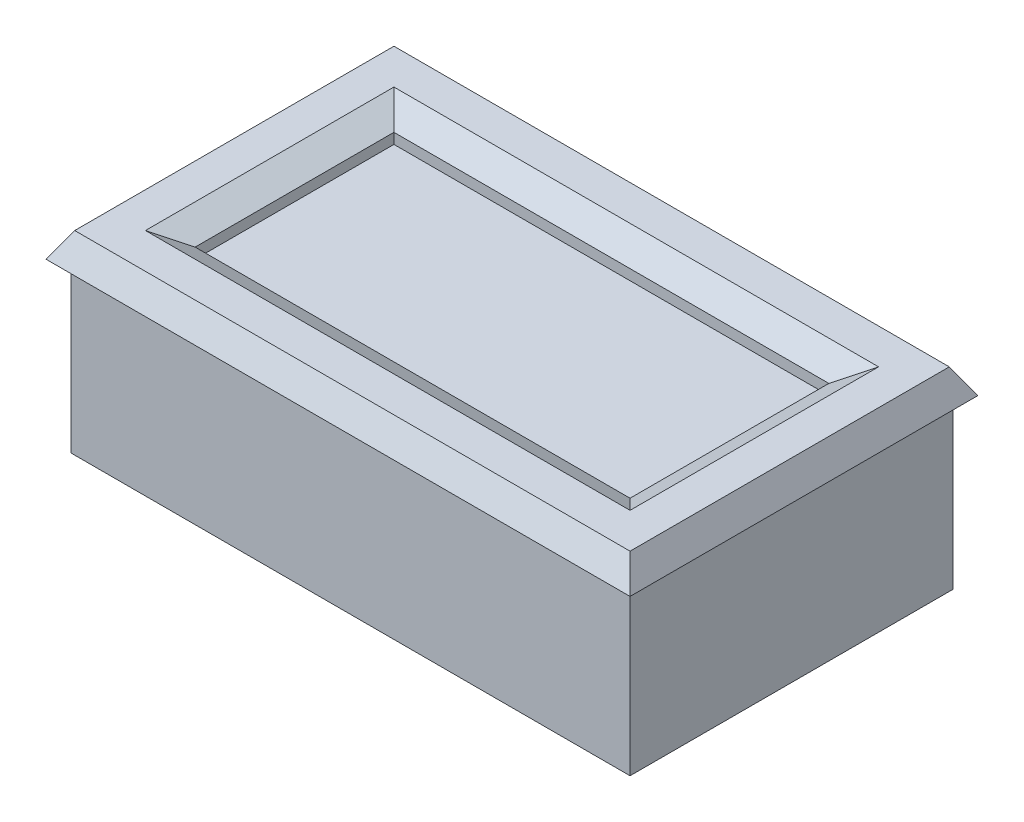
ISO-10303-21;
HEADER;
FILE_DESCRIPTION(('STEP AP214'),'2;1');
FILE_NAME('part.step','',(''),(''),'','','');
FILE_SCHEMA(('AUTOMOTIVE_DESIGN { 1 0 10303 214 1 1 1 1 }'));
ENDSEC;
DATA;
#1=APPLICATION_CONTEXT('core data for automotive mechanical design processes');
#2=APPLICATION_PROTOCOL_DEFINITION('international standard','automotive_design',2000,#1);
#3=PRODUCT_CONTEXT('',#1,'mechanical');
#4=PRODUCT('Part','Part','',(#3));
#5=PRODUCT_RELATED_PRODUCT_CATEGORY('part','',(#4));
#6=PRODUCT_DEFINITION_FORMATION('','',#4);
#7=PRODUCT_DEFINITION_CONTEXT('part definition',#1,'design');
#8=PRODUCT_DEFINITION('design','',#6,#7);
#9=PRODUCT_DEFINITION_SHAPE('','',#8);
#10=(LENGTH_UNIT() NAMED_UNIT(*) SI_UNIT(.MILLI.,.METRE.));
#11=(NAMED_UNIT(*) PLANE_ANGLE_UNIT() SI_UNIT($,.RADIAN.));
#12=(NAMED_UNIT(*) SI_UNIT($,.STERADIAN.) SOLID_ANGLE_UNIT());
#13=UNCERTAINTY_MEASURE_WITH_UNIT(LENGTH_MEASURE(1.E-05),#10,'distance_accuracy_value','');
#14=(GEOMETRIC_REPRESENTATION_CONTEXT(3) GLOBAL_UNCERTAINTY_ASSIGNED_CONTEXT((#13)) GLOBAL_UNIT_ASSIGNED_CONTEXT((#10,
#11,#12)) REPRESENTATION_CONTEXT('',''));
#15=CARTESIAN_POINT('',(0.,0.,0.));
#16=DIRECTION('',(0.,0.,1.));
#17=DIRECTION('',(1.,0.,0.));
#18=AXIS2_PLACEMENT_3D('',#15,#16,#17);
#19=CARTESIAN_POINT('',(22.5,13.5,13.));
#20=DIRECTION('',(-1.,0.,0.));
#21=DIRECTION('',(0.,0.,1.));
#22=AXIS2_PLACEMENT_3D('',#19,#20,#21);
#23=PLANE('',#22);
#24=DIRECTION('',(0.,0.,-1.));
#25=VECTOR('',#24,1.);
#26=CARTESIAN_POINT('',(22.5,0.,13.));
#27=LINE('',#26,#25);
#28=CARTESIAN_POINT('',(22.5,0.,13.));
#29=VERTEX_POINT('',#28);
#30=CARTESIAN_POINT('',(22.5,0.,-13.));
#31=VERTEX_POINT('',#30);
#32=EDGE_CURVE('E237',#29,#31,#27,.T.);
#33=ORIENTED_EDGE('',*,*,#32,.T.);
#34=DIRECTION('',(0.,-1.,0.));
#35=VECTOR('',#34,1.);
#36=CARTESIAN_POINT('',(22.5,13.5,-13.));
#37=LINE('',#36,#35);
#38=CARTESIAN_POINT('',(22.5,13.5,-13.));
#39=VERTEX_POINT('',#38);
#40=EDGE_CURVE('E267',#39,#31,#37,.T.);
#41=ORIENTED_EDGE('',*,*,#40,.F.);
#42=DIRECTION('',(0.,0.,-1.));
#43=VECTOR('',#42,1.);
#44=CARTESIAN_POINT('',(22.5,13.5,13.));
#45=LINE('',#44,#43);
#46=CARTESIAN_POINT('',(22.5,13.5,13.));
#47=VERTEX_POINT('',#46);
#48=EDGE_CURVE('E238',#47,#39,#45,.T.);
#49=ORIENTED_EDGE('',*,*,#48,.F.);
#50=DIRECTION('',(0.,-1.,0.));
#51=VECTOR('',#50,1.);
#52=CARTESIAN_POINT('',(22.5,13.5,13.));
#53=LINE('',#52,#51);
#54=EDGE_CURVE('E251',#47,#29,#53,.T.);
#55=ORIENTED_EDGE('',*,*,#54,.T.);
#56=EDGE_LOOP('',(#33,#41,#49,#55));
#57=FACE_BOUND('',#56,.T.);
#58=ADVANCED_FACE('F38',(#57),#23,.F.);
#59=CARTESIAN_POINT('',(-22.5,13.5,-13.));
#60=DIRECTION('',(0.,0.,1.));
#61=DIRECTION('',(1.,0.,0.));
#62=AXIS2_PLACEMENT_3D('',#59,#60,#61);
#63=PLANE('',#62);
#64=DIRECTION('',(-1.,0.,0.));
#65=VECTOR('',#64,1.);
#66=CARTESIAN_POINT('',(-22.5,0.,-13.));
#67=LINE('',#66,#65);
#68=CARTESIAN_POINT('',(-22.5,0.,-13.));
#69=VERTEX_POINT('',#68);
#70=EDGE_CURVE('E254',#31,#69,#67,.T.);
#71=ORIENTED_EDGE('',*,*,#70,.T.);
#72=DIRECTION('',(0.,-1.,0.));
#73=VECTOR('',#72,1.);
#74=CARTESIAN_POINT('',(-22.5,13.5,-13.));
#75=LINE('',#74,#73);
#76=CARTESIAN_POINT('',(-22.5,13.5,-13.));
#77=VERTEX_POINT('',#76);
#78=EDGE_CURVE('E264',#77,#69,#75,.T.);
#79=ORIENTED_EDGE('',*,*,#78,.F.);
#80=DIRECTION('',(-1.,0.,0.));
#81=VECTOR('',#80,1.);
#82=CARTESIAN_POINT('',(-22.5,13.5,-13.));
#83=LINE('',#82,#81);
#84=EDGE_CURVE('E241',#39,#77,#83,.T.);
#85=ORIENTED_EDGE('',*,*,#84,.F.);
#86=ORIENTED_EDGE('',*,*,#40,.T.);
#87=EDGE_LOOP('',(#71,#79,#85,#86));
#88=FACE_BOUND('',#87,.T.);
#89=ADVANCED_FACE('F342',(#88),#63,.F.);
#90=CARTESIAN_POINT('',(-22.5,13.5,13.));
#91=DIRECTION('',(1.,0.,0.));
#92=DIRECTION('',(0.,0.,-1.));
#93=AXIS2_PLACEMENT_3D('',#90,#91,#92);
#94=PLANE('',#93);
#95=DIRECTION('',(0.,0.,1.));
#96=VECTOR('',#95,1.);
#97=CARTESIAN_POINT('',(-22.5,0.,13.));
#98=LINE('',#97,#96);
#99=CARTESIAN_POINT('',(-22.5,0.,13.));
#100=VERTEX_POINT('',#99);
#101=EDGE_CURVE('E256',#69,#100,#98,.T.);
#102=ORIENTED_EDGE('',*,*,#101,.T.);
#103=DIRECTION('',(0.,-1.,0.));
#104=VECTOR('',#103,1.);
#105=CARTESIAN_POINT('',(-22.5,13.5,13.));
#106=LINE('',#105,#104);
#107=CARTESIAN_POINT('',(-22.5,13.5,13.));
#108=VERTEX_POINT('',#107);
#109=EDGE_CURVE('E261',#108,#100,#106,.T.);
#110=ORIENTED_EDGE('',*,*,#109,.F.);
#111=DIRECTION('',(0.,0.,1.));
#112=VECTOR('',#111,1.);
#113=CARTESIAN_POINT('',(-22.5,13.5,13.));
#114=LINE('',#113,#112);
#115=EDGE_CURVE('E245',#77,#108,#114,.T.);
#116=ORIENTED_EDGE('',*,*,#115,.F.);
#117=ORIENTED_EDGE('',*,*,#78,.T.);
#118=EDGE_LOOP('',(#102,#110,#116,#117));
#119=FACE_BOUND('',#118,.T.);
#120=ADVANCED_FACE('F348',(#119),#94,.F.);
#121=CARTESIAN_POINT('',(-22.5,13.5,13.));
#122=DIRECTION('',(0.,0.,-1.));
#123=DIRECTION('',(-1.,0.,0.));
#124=AXIS2_PLACEMENT_3D('',#121,#122,#123);
#125=PLANE('',#124);
#126=DIRECTION('',(1.,0.,0.));
#127=VECTOR('',#126,1.);
#128=CARTESIAN_POINT('',(-22.5,0.,13.));
#129=LINE('',#128,#127);
#130=EDGE_CURVE('E242',#100,#29,#129,.T.);
#131=ORIENTED_EDGE('',*,*,#130,.T.);
#132=ORIENTED_EDGE('',*,*,#54,.F.);
#133=DIRECTION('',(1.,0.,0.));
#134=VECTOR('',#133,1.);
#135=CARTESIAN_POINT('',(-22.5,13.5,13.));
#136=LINE('',#135,#134);
#137=EDGE_CURVE('E248',#108,#47,#136,.T.);
#138=ORIENTED_EDGE('',*,*,#137,.F.);
#139=ORIENTED_EDGE('',*,*,#109,.T.);
#140=EDGE_LOOP('',(#131,#132,#138,#139));
#141=FACE_BOUND('',#140,.T.);
#142=ADVANCED_FACE('F473',(#141),#125,.F.);
#143=CARTESIAN_POINT('',(0.,0.,0.));
#144=DIRECTION('',(0.,-1.,0.));
#145=DIRECTION('',(0.,0.,-1.));
#146=AXIS2_PLACEMENT_3D('',#143,#144,#145);
#147=PLANE('',#146);
#148=DIRECTION('',(1.,0.,0.));
#149=VECTOR('',#148,1.);
#150=CARTESIAN_POINT('',(-22.,0.,-7.));
#151=LINE('',#150,#149);
#152=CARTESIAN_POINT('',(-22.,0.,-7.));
#153=VERTEX_POINT('',#152);
#154=CARTESIAN_POINT('',(-19.5,0.,-7.));
#155=VERTEX_POINT('',#154);
#156=EDGE_CURVE('E182',#153,#155,#151,.T.);
#157=ORIENTED_EDGE('',*,*,#156,.F.);
#158=DIRECTION('',(0.,0.,-1.));
#159=VECTOR('',#158,1.);
#160=CARTESIAN_POINT('',(-22.,0.,-7.));
#161=LINE('',#160,#159);
#162=CARTESIAN_POINT('',(-22.,0.,-4.));
#163=VERTEX_POINT('',#162);
#164=EDGE_CURVE('E193',#163,#153,#161,.T.);
#165=ORIENTED_EDGE('',*,*,#164,.F.);
#166=DIRECTION('',(-1.,0.,0.));
#167=VECTOR('',#166,1.);
#168=CARTESIAN_POINT('',(-22.,0.,-4.));
#169=LINE('',#168,#167);
#170=CARTESIAN_POINT('',(-19.5,0.,-4.));
#171=VERTEX_POINT('',#170);
#172=EDGE_CURVE('E56',#171,#163,#169,.T.);
#173=ORIENTED_EDGE('',*,*,#172,.F.);
#174=CARTESIAN_POINT('',(-19.5,0.,-5.5));
#175=DIRECTION('',(0.,-1.,0.));
#176=DIRECTION('',(0.,0.,1.));
#177=AXIS2_PLACEMENT_3D('',#174,#175,#176);
#178=CIRCLE('',#177,1.5);
#179=EDGE_CURVE('E189',#155,#171,#178,.T.);
#180=ORIENTED_EDGE('',*,*,#179,.F.);
#181=EDGE_LOOP('',(#157,#165,#173,#180));
#182=FACE_BOUND('',#181,.T.);
#183=ORIENTED_EDGE('',*,*,#32,.F.);
#184=ORIENTED_EDGE('',*,*,#130,.F.);
#185=ORIENTED_EDGE('',*,*,#101,.F.);
#186=ORIENTED_EDGE('',*,*,#70,.F.);
#187=EDGE_LOOP('',(#183,#184,#185,#186));
#188=FACE_BOUND('',#187,.T.);
#189=ADVANCED_FACE('F339',(#182,#188),#147,.T.);
#190=CARTESIAN_POINT('',(0.,13.5,0.));
#191=DIRECTION('',(0.,1.,0.));
#192=DIRECTION('',(0.,0.,1.));
#193=AXIS2_PLACEMENT_3D('',#190,#191,#192);
#194=PLANE('',#193);
#195=DIRECTION('',(1.,0.,0.));
#196=VECTOR('',#195,1.);
#197=CARTESIAN_POINT('',(-23.5,13.5,14.));
#198=LINE('',#197,#196);
#199=CARTESIAN_POINT('',(-23.5,13.5,14.));
#200=VERTEX_POINT('',#199);
#201=CARTESIAN_POINT('',(23.5,13.5,14.));
#202=VERTEX_POINT('',#201);
#203=EDGE_CURVE('E225',#200,#202,#198,.T.);
#204=ORIENTED_EDGE('',*,*,#203,.F.);
#205=DIRECTION('',(0.,0.,1.));
#206=VECTOR('',#205,1.);
#207=CARTESIAN_POINT('',(-23.5,13.5,-14.));
#208=LINE('',#207,#206);
#209=CARTESIAN_POINT('',(-23.5,13.5,-14.));
#210=VERTEX_POINT('',#209);
#211=EDGE_CURVE('E234',#210,#200,#208,.T.);
#212=ORIENTED_EDGE('',*,*,#211,.F.);
#213=DIRECTION('',(-1.,0.,0.));
#214=VECTOR('',#213,1.);
#215=CARTESIAN_POINT('',(23.5,13.5,-14.));
#216=LINE('',#215,#214);
#217=CARTESIAN_POINT('',(23.5,13.5,-14.));
#218=VERTEX_POINT('',#217);
#219=EDGE_CURVE('E231',#218,#210,#216,.T.);
#220=ORIENTED_EDGE('',*,*,#219,.F.);
#221=DIRECTION('',(0.,0.,-1.));
#222=VECTOR('',#221,1.);
#223=CARTESIAN_POINT('',(23.5,13.5,14.));
#224=LINE('',#223,#222);
#225=EDGE_CURVE('E228',#202,#218,#224,.T.);
#226=ORIENTED_EDGE('',*,*,#225,.F.);
#227=EDGE_LOOP('',(#204,#212,#220,#226));
#228=FACE_BOUND('',#227,.T.);
#229=ORIENTED_EDGE('',*,*,#137,.T.);
#230=ORIENTED_EDGE('',*,*,#48,.T.);
#231=ORIENTED_EDGE('',*,*,#84,.T.);
#232=ORIENTED_EDGE('',*,*,#115,.T.);
#233=EDGE_LOOP('',(#229,#230,#231,#232));
#234=FACE_BOUND('',#233,.T.);
#235=ADVANCED_FACE('F320',(#228,#234),#194,.F.);
#236=CARTESIAN_POINT('',(0.,15.5,0.));
#237=DIRECTION('',(0.,1.,0.));
#238=DIRECTION('',(0.,0.,1.));
#239=AXIS2_PLACEMENT_3D('',#236,#237,#238);
#240=PLANE('',#239);
#241=DIRECTION('',(0.,0.,-1.));
#242=VECTOR('',#241,1.);
#243=CARTESIAN_POINT('',(-19.5,15.5,0.));
#244=LINE('',#243,#242);
#245=CARTESIAN_POINT('',(-19.5,15.5,10.));
#246=VERTEX_POINT('',#245);
#247=CARTESIAN_POINT('',(-19.5,15.5,-10.));
#248=VERTEX_POINT('',#247);
#249=EDGE_CURVE('E286',#246,#248,#244,.T.);
#250=ORIENTED_EDGE('',*,*,#249,.T.);
#251=DIRECTION('',(1.,0.,0.));
#252=VECTOR('',#251,1.);
#253=CARTESIAN_POINT('',(0.,15.5,-10.));
#254=LINE('',#253,#252);
#255=CARTESIAN_POINT('',(19.5,15.5,-10.));
#256=VERTEX_POINT('',#255);
#257=EDGE_CURVE('E288',#248,#256,#254,.T.);
#258=ORIENTED_EDGE('',*,*,#257,.T.);
#259=DIRECTION('',(0.,0.,1.));
#260=VECTOR('',#259,1.);
#261=CARTESIAN_POINT('',(19.5,15.5,0.));
#262=LINE('',#261,#260);
#263=CARTESIAN_POINT('',(19.5,15.5,10.));
#264=VERTEX_POINT('',#263);
#265=EDGE_CURVE('E282',#256,#264,#262,.T.);
#266=ORIENTED_EDGE('',*,*,#265,.T.);
#267=DIRECTION('',(-1.,0.,0.));
#268=VECTOR('',#267,1.);
#269=CARTESIAN_POINT('',(0.,15.5,10.));
#270=LINE('',#269,#268);
#271=EDGE_CURVE('E284',#264,#246,#270,.T.);
#272=ORIENTED_EDGE('',*,*,#271,.T.);
#273=EDGE_LOOP('',(#250,#258,#266,#272));
#274=FACE_BOUND('',#273,.T.);
#275=DIRECTION('',(-1.,0.,0.));
#276=VECTOR('',#275,1.);
#277=CARTESIAN_POINT('',(-23.5,15.5,-12.8452994616207));
#278=LINE('',#277,#276);
#279=CARTESIAN_POINT('',(22.3452994616207,15.5,-12.8452994616207));
#280=VERTEX_POINT('',#279);
#281=CARTESIAN_POINT('',(-22.3452994616208,15.5,-12.8452994616207));
#282=VERTEX_POINT('',#281);
#283=EDGE_CURVE('E277',#280,#282,#278,.T.);
#284=ORIENTED_EDGE('',*,*,#283,.T.);
#285=DIRECTION('',(0.,0.,1.));
#286=VECTOR('',#285,1.);
#287=CARTESIAN_POINT('',(-22.3452994616208,15.5,14.));
#288=LINE('',#287,#286);
#289=CARTESIAN_POINT('',(-22.3452994616208,15.5,12.8452994616208));
#290=VERTEX_POINT('',#289);
#291=EDGE_CURVE('E279',#282,#290,#288,.T.);
#292=ORIENTED_EDGE('',*,*,#291,.T.);
#293=DIRECTION('',(1.,0.,0.));
#294=VECTOR('',#293,1.);
#295=CARTESIAN_POINT('',(23.5,15.5,12.8452994616208));
#296=LINE('',#295,#294);
#297=CARTESIAN_POINT('',(22.3452994616207,15.5,12.8452994616208));
#298=VERTEX_POINT('',#297);
#299=EDGE_CURVE('E273',#290,#298,#296,.T.);
#300=ORIENTED_EDGE('',*,*,#299,.T.);
#301=DIRECTION('',(0.,0.,-1.));
#302=VECTOR('',#301,1.);
#303=CARTESIAN_POINT('',(22.3452994616207,15.5,-14.));
#304=LINE('',#303,#302);
#305=EDGE_CURVE('E275',#298,#280,#304,.T.);
#306=ORIENTED_EDGE('',*,*,#305,.T.);
#307=EDGE_LOOP('',(#284,#292,#300,#306));
#308=FACE_BOUND('',#307,.T.);
#309=ADVANCED_FACE('F328',(#274,#308),#240,.T.);
#310=CARTESIAN_POINT('',(-17.5,15.5,8.));
#311=DIRECTION('',(0.,0.,-1.));
#312=DIRECTION('',(-1.,0.,0.));
#313=AXIS2_PLACEMENT_3D('',#310,#311,#312);
#314=PLANE('',#313);
#315=DIRECTION('',(0.,-1.,0.));
#316=VECTOR('',#315,1.);
#317=CARTESIAN_POINT('',(-17.5,15.5,8.));
#318=LINE('',#317,#316);
#319=CARTESIAN_POINT('',(-17.5,14.3452994616207,8.));
#320=VERTEX_POINT('',#319);
#321=CARTESIAN_POINT('',(-17.5,13.5,8.));
#322=VERTEX_POINT('',#321);
#323=EDGE_CURVE('E217',#320,#322,#318,.T.);
#324=ORIENTED_EDGE('',*,*,#323,.F.);
#325=DIRECTION('',(1.,0.,0.));
#326=VECTOR('',#325,1.);
#327=CARTESIAN_POINT('',(-17.5,14.3452994616207,8.));
#328=LINE('',#327,#326);
#329=CARTESIAN_POINT('',(17.5,14.3452994616207,8.));
#330=VERTEX_POINT('',#329);
#331=EDGE_CURVE('E48',#320,#330,#328,.T.);
#332=ORIENTED_EDGE('',*,*,#331,.T.);
#333=DIRECTION('',(0.,-1.,0.));
#334=VECTOR('',#333,1.);
#335=CARTESIAN_POINT('',(17.5,15.5,8.));
#336=LINE('',#335,#334);
#337=CARTESIAN_POINT('',(17.5,13.5,8.));
#338=VERTEX_POINT('',#337);
#339=EDGE_CURVE('E223',#330,#338,#336,.T.);
#340=ORIENTED_EDGE('',*,*,#339,.T.);
#341=DIRECTION('',(1.,0.,0.));
#342=VECTOR('',#341,1.);
#343=CARTESIAN_POINT('',(-17.5,13.5,8.));
#344=LINE('',#343,#342);
#345=EDGE_CURVE('E204',#322,#338,#344,.T.);
#346=ORIENTED_EDGE('',*,*,#345,.F.);
#347=EDGE_LOOP('',(#324,#332,#340,#346));
#348=FACE_BOUND('',#347,.T.);
#349=ADVANCED_FACE('F330',(#348),#314,.T.);
#350=CARTESIAN_POINT('',(17.5,15.5,8.));
#351=DIRECTION('',(-1.,0.,0.));
#352=DIRECTION('',(0.,0.,1.));
#353=AXIS2_PLACEMENT_3D('',#350,#351,#352);
#354=PLANE('',#353);
#355=ORIENTED_EDGE('',*,*,#339,.F.);
#356=DIRECTION('',(0.,0.,-1.));
#357=VECTOR('',#356,1.);
#358=CARTESIAN_POINT('',(17.5,14.3452994616207,8.));
#359=LINE('',#358,#357);
#360=CARTESIAN_POINT('',(17.5,14.3452994616207,-8.));
#361=VERTEX_POINT('',#360);
#362=EDGE_CURVE('E11',#330,#361,#359,.T.);
#363=ORIENTED_EDGE('',*,*,#362,.T.);
#364=DIRECTION('',(0.,-1.,0.));
#365=VECTOR('',#364,1.);
#366=CARTESIAN_POINT('',(17.5,15.5,-8.));
#367=LINE('',#366,#365);
#368=CARTESIAN_POINT('',(17.5,13.5,-8.));
#369=VERTEX_POINT('',#368);
#370=EDGE_CURVE('E221',#361,#369,#367,.T.);
#371=ORIENTED_EDGE('',*,*,#370,.T.);
#372=DIRECTION('',(0.,0.,-1.));
#373=VECTOR('',#372,1.);
#374=CARTESIAN_POINT('',(17.5,13.5,8.));
#375=LINE('',#374,#373);
#376=EDGE_CURVE('E207',#338,#369,#375,.T.);
#377=ORIENTED_EDGE('',*,*,#376,.F.);
#378=EDGE_LOOP('',(#355,#363,#371,#377));
#379=FACE_BOUND('',#378,.T.);
#380=ADVANCED_FACE('F337',(#379),#354,.T.);
#381=CARTESIAN_POINT('',(17.5,15.5,-8.));
#382=DIRECTION('',(0.,0.,1.));
#383=DIRECTION('',(1.,0.,0.));
#384=AXIS2_PLACEMENT_3D('',#381,#382,#383);
#385=PLANE('',#384);
#386=ORIENTED_EDGE('',*,*,#370,.F.);
#387=DIRECTION('',(-1.,0.,0.));
#388=VECTOR('',#387,1.);
#389=CARTESIAN_POINT('',(17.5,14.3452994616207,-8.));
#390=LINE('',#389,#388);
#391=CARTESIAN_POINT('',(-17.5,14.3452994616207,-8.));
#392=VERTEX_POINT('',#391);
#393=EDGE_CURVE('E270',#361,#392,#390,.T.);
#394=ORIENTED_EDGE('',*,*,#393,.T.);
#395=DIRECTION('',(0.,-1.,0.));
#396=VECTOR('',#395,1.);
#397=CARTESIAN_POINT('',(-17.5,15.5,-8.));
#398=LINE('',#397,#396);
#399=CARTESIAN_POINT('',(-17.5,13.5,-8.));
#400=VERTEX_POINT('',#399);
#401=EDGE_CURVE('E219',#392,#400,#398,.T.);
#402=ORIENTED_EDGE('',*,*,#401,.T.);
#403=DIRECTION('',(-1.,0.,0.));
#404=VECTOR('',#403,1.);
#405=CARTESIAN_POINT('',(17.5,13.5,-8.));
#406=LINE('',#405,#404);
#407=EDGE_CURVE('E211',#369,#400,#406,.T.);
#408=ORIENTED_EDGE('',*,*,#407,.F.);
#409=EDGE_LOOP('',(#386,#394,#402,#408));
#410=FACE_BOUND('',#409,.T.);
#411=ADVANCED_FACE('F431',(#410),#385,.T.);
#412=CARTESIAN_POINT('',(-17.5,15.5,-8.));
#413=DIRECTION('',(1.,0.,0.));
#414=DIRECTION('',(0.,0.,-1.));
#415=AXIS2_PLACEMENT_3D('',#412,#413,#414);
#416=PLANE('',#415);
#417=ORIENTED_EDGE('',*,*,#401,.F.);
#418=DIRECTION('',(0.,0.,1.));
#419=VECTOR('',#418,1.);
#420=CARTESIAN_POINT('',(-17.5,14.3452994616207,-8.));
#421=LINE('',#420,#419);
#422=EDGE_CURVE('E291',#392,#320,#421,.T.);
#423=ORIENTED_EDGE('',*,*,#422,.T.);
#424=ORIENTED_EDGE('',*,*,#323,.T.);
#425=DIRECTION('',(0.,0.,1.));
#426=VECTOR('',#425,1.);
#427=CARTESIAN_POINT('',(-17.5,13.5,-8.));
#428=LINE('',#427,#426);
#429=EDGE_CURVE('E214',#400,#322,#428,.T.);
#430=ORIENTED_EDGE('',*,*,#429,.F.);
#431=EDGE_LOOP('',(#417,#423,#424,#430));
#432=FACE_BOUND('',#431,.T.);
#433=ADVANCED_FACE('F423',(#432),#416,.T.);
#434=CARTESIAN_POINT('',(0.,13.5,0.));
#435=DIRECTION('',(0.,-1.,0.));
#436=DIRECTION('',(0.,0.,-1.));
#437=AXIS2_PLACEMENT_3D('',#434,#435,#436);
#438=PLANE('',#437);
#439=ORIENTED_EDGE('',*,*,#429,.T.);
#440=ORIENTED_EDGE('',*,*,#345,.T.);
#441=ORIENTED_EDGE('',*,*,#376,.T.);
#442=ORIENTED_EDGE('',*,*,#407,.T.);
#443=EDGE_LOOP('',(#439,#440,#441,#442));
#444=FACE_BOUND('',#443,.T.);
#445=ADVANCED_FACE('F380',(#444),#438,.F.);
#446=CARTESIAN_POINT('',(-17.5,14.3452994616207,8.));
#447=DIRECTION('',(0.,-0.86602540378444,0.499999999999999));
#448=DIRECTION('',(1.,0.,0.));
#449=AXIS2_PLACEMENT_3D('',#446,#447,#448);
#450=PLANE('',#449);
#451=DIRECTION('',(-0.654653670707978,0.377964473009226,0.654653670707978));
#452=VECTOR('',#451,1.);
#453=CARTESIAN_POINT('',(-10.6428571428571,10.3863261871776,1.14285714285714));
#454=LINE('',#453,#452);
#455=EDGE_CURVE('E298',#246,#320,#454,.F.);
#456=ORIENTED_EDGE('',*,*,#455,.F.);
#457=ORIENTED_EDGE('',*,*,#271,.F.);
#458=DIRECTION('',(0.654653670707978,0.377964473009226,0.654653670707978));
#459=VECTOR('',#458,1.);
#460=CARTESIAN_POINT('',(2.49999999999998,5.68504542377639,-7.00000000000001));
#461=LINE('',#460,#459);
#462=EDGE_CURVE('E208',#330,#264,#461,.T.);
#463=ORIENTED_EDGE('',*,*,#462,.F.);
#464=ORIENTED_EDGE('',*,*,#331,.F.);
#465=EDGE_LOOP('',(#456,#457,#463,#464));
#466=FACE_BOUND('',#465,.T.);
#467=ADVANCED_FACE('F374',(#466),#450,.F.);
#468=CARTESIAN_POINT('',(17.5,14.3452994616207,8.));
#469=DIRECTION('',(0.499999999999999,-0.86602540378444,0.));
#470=DIRECTION('',(0.,0.,-1.));
#471=AXIS2_PLACEMENT_3D('',#468,#469,#470);
#472=PLANE('',#471);
#473=ORIENTED_EDGE('',*,*,#462,.T.);
#474=ORIENTED_EDGE('',*,*,#265,.F.);
#475=DIRECTION('',(-0.654653670707978,-0.377964473009226,0.654653670707978));
#476=VECTOR('',#475,1.);
#477=CARTESIAN_POINT('',(17.5,14.3452994616207,-8.));
#478=LINE('',#477,#476);
#479=EDGE_CURVE('E296',#361,#256,#478,.F.);
#480=ORIENTED_EDGE('',*,*,#479,.F.);
#481=ORIENTED_EDGE('',*,*,#362,.F.);
#482=EDGE_LOOP('',(#473,#474,#480,#481));
#483=FACE_BOUND('',#482,.T.);
#484=ADVANCED_FACE('F367',(#483),#472,.F.);
#485=CARTESIAN_POINT('',(-17.5,14.3452994616207,-8.));
#486=DIRECTION('',(-0.499999999999999,-0.86602540378444,0.));
#487=DIRECTION('',(0.,0.,1.));
#488=AXIS2_PLACEMENT_3D('',#485,#486,#487);
#489=PLANE('',#488);
#490=ORIENTED_EDGE('',*,*,#455,.T.);
#491=ORIENTED_EDGE('',*,*,#422,.F.);
#492=DIRECTION('',(-0.654653670707978,0.377964473009226,-0.654653670707978));
#493=VECTOR('',#492,1.);
#494=CARTESIAN_POINT('',(-2.49999999999998,5.68504542377639,7.00000000000002));
#495=LINE('',#494,#493);
#496=EDGE_CURVE('E294',#248,#392,#495,.F.);
#497=ORIENTED_EDGE('',*,*,#496,.F.);
#498=ORIENTED_EDGE('',*,*,#249,.F.);
#499=EDGE_LOOP('',(#490,#491,#497,#498));
#500=FACE_BOUND('',#499,.T.);
#501=ADVANCED_FACE('F360',(#500),#489,.F.);
#502=CARTESIAN_POINT('',(17.5,14.3452994616207,-8.));
#503=DIRECTION('',(0.,-0.86602540378444,-0.499999999999999));
#504=DIRECTION('',(-1.,0.,0.));
#505=AXIS2_PLACEMENT_3D('',#502,#503,#504);
#506=PLANE('',#505);
#507=ORIENTED_EDGE('',*,*,#479,.T.);
#508=ORIENTED_EDGE('',*,*,#257,.F.);
#509=ORIENTED_EDGE('',*,*,#496,.T.);
#510=ORIENTED_EDGE('',*,*,#393,.F.);
#511=EDGE_LOOP('',(#507,#508,#509,#510));
#512=FACE_BOUND('',#511,.T.);
#513=ADVANCED_FACE('F354',(#512),#506,.F.);
#514=CARTESIAN_POINT('',(22.3452994616207,15.5,0.));
#515=DIRECTION('',(0.866025403784439,0.499999999999999,0.));
#516=DIRECTION('',(0.,0.,1.));
#517=AXIS2_PLACEMENT_3D('',#514,#515,#516);
#518=PLANE('',#517);
#519=DIRECTION('',(-0.447213595499957,0.774596669241484,-0.447213595499957));
#520=VECTOR('',#519,1.);
#521=CARTESIAN_POINT('',(17.8762395692966,23.2406387955737,8.37623956929662));
#522=LINE('',#521,#520);
#523=EDGE_CURVE('E305',#202,#298,#522,.T.);
#524=ORIENTED_EDGE('',*,*,#523,.F.);
#525=ORIENTED_EDGE('',*,*,#225,.T.);
#526=DIRECTION('',(-0.447213595499957,0.774596669241484,0.447213595499957));
#527=VECTOR('',#526,1.);
#528=CARTESIAN_POINT('',(19.7762395692966,19.9497422611929,-10.2762395692966));
#529=LINE('',#528,#527);
#530=EDGE_CURVE('E43',#280,#218,#529,.F.);
#531=ORIENTED_EDGE('',*,*,#530,.F.);
#532=ORIENTED_EDGE('',*,*,#305,.F.);
#533=EDGE_LOOP('',(#524,#525,#531,#532));
#534=FACE_BOUND('',#533,.T.);
#535=ADVANCED_FACE('F41',(#534),#518,.T.);
#536=CARTESIAN_POINT('',(0.,15.5,-12.8452994616207));
#537=DIRECTION('',(0.,0.499999999999999,-0.866025403784439));
#538=DIRECTION('',(1.,0.,0.));
#539=AXIS2_PLACEMENT_3D('',#536,#537,#538);
#540=PLANE('',#539);
#541=ORIENTED_EDGE('',*,*,#530,.T.);
#542=ORIENTED_EDGE('',*,*,#219,.T.);
#543=DIRECTION('',(0.447213595499957,0.774596669241484,0.447213595499957));
#544=VECTOR('',#543,1.);
#545=CARTESIAN_POINT('',(-17.8762395692966,23.2406387955737,-8.37623956929661));
#546=LINE('',#545,#544);
#547=EDGE_CURVE('E304',#282,#210,#546,.F.);
#548=ORIENTED_EDGE('',*,*,#547,.F.);
#549=ORIENTED_EDGE('',*,*,#283,.F.);
#550=EDGE_LOOP('',(#541,#542,#548,#549));
#551=FACE_BOUND('',#550,.T.);
#552=ADVANCED_FACE('F314',(#551),#540,.T.);
#553=CARTESIAN_POINT('',(0.,15.5,12.8452994616208));
#554=DIRECTION('',(0.,0.499999999999999,0.866025403784439));
#555=DIRECTION('',(-1.,0.,0.));
#556=AXIS2_PLACEMENT_3D('',#553,#554,#555);
#557=PLANE('',#556);
#558=ORIENTED_EDGE('',*,*,#523,.T.);
#559=ORIENTED_EDGE('',*,*,#299,.F.);
#560=DIRECTION('',(-0.447213595499957,-0.774596669241484,0.447213595499957));
#561=VECTOR('',#560,1.);
#562=CARTESIAN_POINT('',(-17.8762395692966,23.2406387955737,8.37623956929662));
#563=LINE('',#562,#561);
#564=EDGE_CURVE('E203',#200,#290,#563,.F.);
#565=ORIENTED_EDGE('',*,*,#564,.F.);
#566=ORIENTED_EDGE('',*,*,#203,.T.);
#567=EDGE_LOOP('',(#558,#559,#565,#566));
#568=FACE_BOUND('',#567,.T.);
#569=ADVANCED_FACE('F326',(#568),#557,.T.);
#570=CARTESIAN_POINT('',(-22.3452994616208,15.5,0.));
#571=DIRECTION('',(-0.866025403784439,0.499999999999999,0.));
#572=DIRECTION('',(0.,0.,-1.));
#573=AXIS2_PLACEMENT_3D('',#570,#571,#572);
#574=PLANE('',#573);
#575=ORIENTED_EDGE('',*,*,#547,.T.);
#576=ORIENTED_EDGE('',*,*,#211,.T.);
#577=ORIENTED_EDGE('',*,*,#564,.T.);
#578=ORIENTED_EDGE('',*,*,#291,.F.);
#579=EDGE_LOOP('',(#575,#576,#577,#578));
#580=FACE_BOUND('',#579,.T.);
#581=ADVANCED_FACE('F324',(#580),#574,.T.);
#582=CARTESIAN_POINT('',(0.,13.5,0.));
#583=DIRECTION('',(0.,1.,0.));
#584=DIRECTION('',(0.,0.,1.));
#585=AXIS2_PLACEMENT_3D('',#582,#583,#584);
#586=PLANE('',#585);
#587=DIRECTION('',(0.,0.,-1.));
#588=VECTOR('',#587,1.);
#589=CARTESIAN_POINT('',(-22.,13.5,-7.));
#590=LINE('',#589,#588);
#591=CARTESIAN_POINT('',(-22.,13.5,-4.));
#592=VERTEX_POINT('',#591);
#593=CARTESIAN_POINT('',(-22.,13.5,-7.));
#594=VERTEX_POINT('',#593);
#595=EDGE_CURVE('E186',#592,#594,#590,.T.);
#596=ORIENTED_EDGE('',*,*,#595,.T.);
#597=DIRECTION('',(1.,0.,0.));
#598=VECTOR('',#597,1.);
#599=CARTESIAN_POINT('',(-22.,13.5,-7.));
#600=LINE('',#599,#598);
#601=CARTESIAN_POINT('',(-19.5,13.5,-7.));
#602=VERTEX_POINT('',#601);
#603=EDGE_CURVE('E179',#594,#602,#600,.T.);
#604=ORIENTED_EDGE('',*,*,#603,.T.);
#605=CARTESIAN_POINT('',(-19.5,13.5,-5.5));
#606=DIRECTION('',(0.,1.,0.));
#607=DIRECTION('',(0.,0.,1.));
#608=AXIS2_PLACEMENT_3D('',#605,#606,#607);
#609=CIRCLE('',#608,1.5);
#610=CARTESIAN_POINT('',(-19.5,13.5,-4.));
#611=VERTEX_POINT('',#610);
#612=EDGE_CURVE('E166',#602,#611,#609,.F.);
#613=ORIENTED_EDGE('',*,*,#612,.T.);
#614=DIRECTION('',(-1.,0.,0.));
#615=VECTOR('',#614,1.);
#616=CARTESIAN_POINT('',(-22.,13.5,-4.));
#617=LINE('',#616,#615);
#618=EDGE_CURVE('E198',#611,#592,#617,.T.);
#619=ORIENTED_EDGE('',*,*,#618,.T.);
#620=EDGE_LOOP('',(#596,#604,#613,#619));
#621=FACE_BOUND('',#620,.T.);
#622=ADVANCED_FACE('F185',(#621),#586,.F.);
#623=CARTESIAN_POINT('',(-22.,18.5,-7.));
#624=DIRECTION('',(0.,0.,-1.));
#625=DIRECTION('',(-1.,0.,0.));
#626=AXIS2_PLACEMENT_3D('',#623,#624,#625);
#627=PLANE('',#626);
#628=DIRECTION('',(0.,-1.,0.));
#629=VECTOR('',#628,1.);
#630=CARTESIAN_POINT('',(-22.,18.5,-7.));
#631=LINE('',#630,#629);
#632=EDGE_CURVE('E196',#594,#153,#631,.T.);
#633=ORIENTED_EDGE('',*,*,#632,.T.);
#634=ORIENTED_EDGE('',*,*,#156,.T.);
#635=DIRECTION('',(0.,-1.,0.));
#636=VECTOR('',#635,1.);
#637=CARTESIAN_POINT('',(-19.5,18.5,-7.));
#638=LINE('',#637,#636);
#639=EDGE_CURVE('E170',#602,#155,#638,.T.);
#640=ORIENTED_EDGE('',*,*,#639,.F.);
#641=ORIENTED_EDGE('',*,*,#603,.F.);
#642=EDGE_LOOP('',(#633,#634,#640,#641));
#643=FACE_BOUND('',#642,.T.);
#644=ADVANCED_FACE('F178',(#643),#627,.F.);
#645=CARTESIAN_POINT('',(-19.5,18.5,-5.5));
#646=DIRECTION('',(0.,-1.,0.));
#647=DIRECTION('',(0.,0.,-1.));
#648=AXIS2_PLACEMENT_3D('',#645,#646,#647);
#649=CYLINDRICAL_SURFACE('',#648,1.5);
#650=ORIENTED_EDGE('',*,*,#639,.T.);
#651=ORIENTED_EDGE('',*,*,#179,.T.);
#652=DIRECTION('',(0.,-1.,0.));
#653=VECTOR('',#652,1.);
#654=CARTESIAN_POINT('',(-19.5,18.5,-4.));
#655=LINE('',#654,#653);
#656=EDGE_CURVE('E172',#611,#171,#655,.T.);
#657=ORIENTED_EDGE('',*,*,#656,.F.);
#658=ORIENTED_EDGE('',*,*,#612,.F.);
#659=EDGE_LOOP('',(#650,#651,#657,#658));
#660=FACE_BOUND('',#659,.T.);
#661=ADVANCED_FACE('F168',(#660),#649,.F.);
#662=CARTESIAN_POINT('',(-22.,18.5,-4.));
#663=DIRECTION('',(0.,0.,1.));
#664=DIRECTION('',(1.,0.,0.));
#665=AXIS2_PLACEMENT_3D('',#662,#663,#664);
#666=PLANE('',#665);
#667=ORIENTED_EDGE('',*,*,#656,.T.);
#668=ORIENTED_EDGE('',*,*,#172,.T.);
#669=DIRECTION('',(0.,-1.,0.));
#670=VECTOR('',#669,1.);
#671=CARTESIAN_POINT('',(-22.,18.5,-4.));
#672=LINE('',#671,#670);
#673=EDGE_CURVE('E197',#592,#163,#672,.T.);
#674=ORIENTED_EDGE('',*,*,#673,.F.);
#675=ORIENTED_EDGE('',*,*,#618,.F.);
#676=EDGE_LOOP('',(#667,#668,#674,#675));
#677=FACE_BOUND('',#676,.T.);
#678=ADVANCED_FACE('F516',(#677),#666,.F.);
#679=CARTESIAN_POINT('',(-22.,18.5,-7.));
#680=DIRECTION('',(-1.,0.,0.));
#681=DIRECTION('',(0.,0.,1.));
#682=AXIS2_PLACEMENT_3D('',#679,#680,#681);
#683=PLANE('',#682);
#684=ORIENTED_EDGE('',*,*,#673,.T.);
#685=ORIENTED_EDGE('',*,*,#164,.T.);
#686=ORIENTED_EDGE('',*,*,#632,.F.);
#687=ORIENTED_EDGE('',*,*,#595,.F.);
#688=EDGE_LOOP('',(#684,#685,#686,#687));
#689=FACE_BOUND('',#688,.T.);
#690=ADVANCED_FACE('F515',(#689),#683,.F.);
#691=CLOSED_SHELL('',(#58,#89,#120,#142,#189,#235,#309,#349,#380,#411,#433,#445,#467,#484,#501,
#513,#535,#552,#569,#581,#622,#644,#661,#678,#690));
#692=MANIFOLD_SOLID_BREP('B2',#691);
#693=ADVANCED_BREP_SHAPE_REPRESENTATION('',(#18,#692),#14);
#694=SHAPE_DEFINITION_REPRESENTATION(#9,#693);
ENDSEC;
END-ISO-10303-21;
